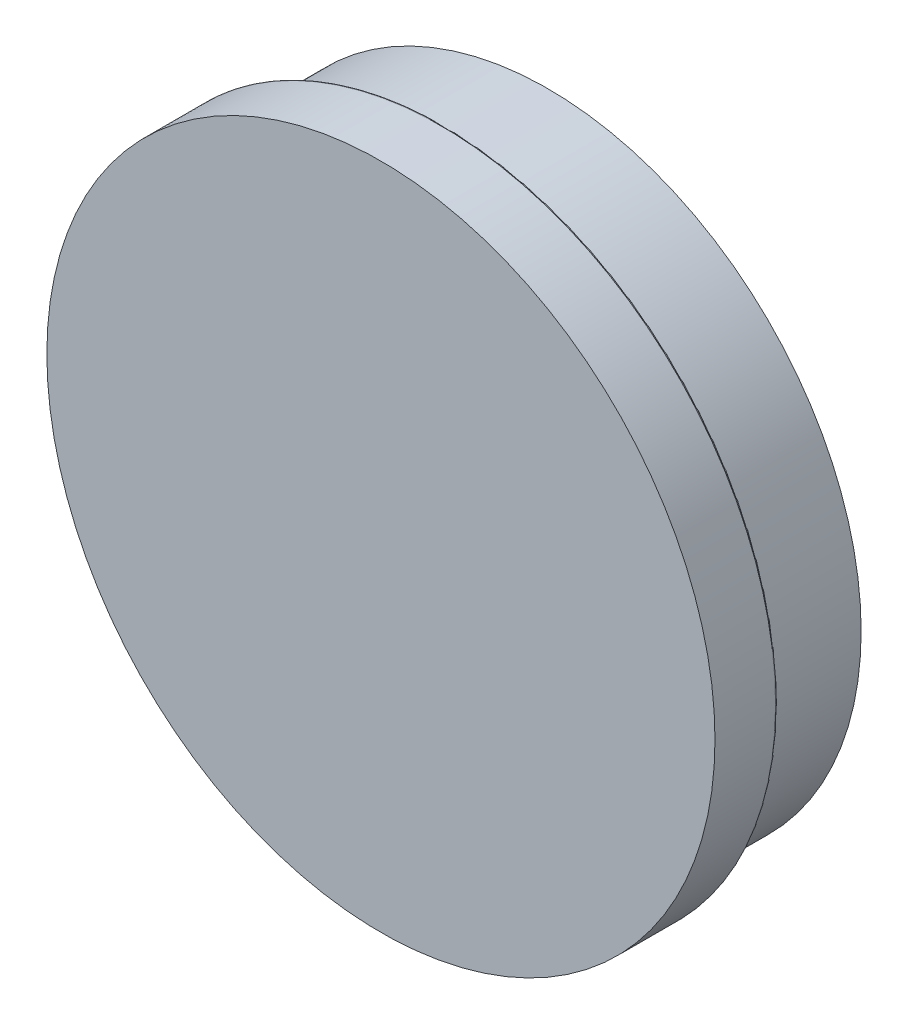
ISO-10303-21;
HEADER;
FILE_DESCRIPTION(('STEP AP214'),'2;1');
FILE_NAME('part.step','',(''),(''),'','','');
FILE_SCHEMA(('AUTOMOTIVE_DESIGN { 1 0 10303 214 1 1 1 1 }'));
ENDSEC;
DATA;
#1=APPLICATION_CONTEXT('core data for automotive mechanical design processes');
#2=APPLICATION_PROTOCOL_DEFINITION('international standard','automotive_design',2000,#1);
#3=PRODUCT_CONTEXT('',#1,'mechanical');
#4=PRODUCT('Part','Part','',(#3));
#5=PRODUCT_RELATED_PRODUCT_CATEGORY('part','',(#4));
#6=PRODUCT_DEFINITION_FORMATION('','',#4);
#7=PRODUCT_DEFINITION_CONTEXT('part definition',#1,'design');
#8=PRODUCT_DEFINITION('design','',#6,#7);
#9=PRODUCT_DEFINITION_SHAPE('','',#8);
#10=(LENGTH_UNIT() NAMED_UNIT(*) SI_UNIT(.MILLI.,.METRE.));
#11=(NAMED_UNIT(*) PLANE_ANGLE_UNIT() SI_UNIT($,.RADIAN.));
#12=(NAMED_UNIT(*) SI_UNIT($,.STERADIAN.) SOLID_ANGLE_UNIT());
#13=UNCERTAINTY_MEASURE_WITH_UNIT(LENGTH_MEASURE(1.E-05),#10,'distance_accuracy_value','');
#14=(GEOMETRIC_REPRESENTATION_CONTEXT(3) GLOBAL_UNCERTAINTY_ASSIGNED_CONTEXT((#13)) GLOBAL_UNIT_ASSIGNED_CONTEXT((#10,
#11,#12)) REPRESENTATION_CONTEXT('',''));
#15=CARTESIAN_POINT('',(0.,0.,0.));
#16=DIRECTION('',(0.,0.,1.));
#17=DIRECTION('',(1.,0.,0.));
#18=AXIS2_PLACEMENT_3D('',#15,#16,#17);
#19=CARTESIAN_POINT('',(0.,0.,5.));
#20=DIRECTION('',(0.,0.,-1.));
#21=DIRECTION('',(-1.,0.,0.));
#22=AXIS2_PLACEMENT_3D('',#19,#20,#21);
#23=CYLINDRICAL_SURFACE('',#22,15.);
#24=CARTESIAN_POINT('',(0.,0.,4.9));
#25=DIRECTION('',(0.,0.,1.));
#26=DIRECTION('',(1.,0.,0.));
#27=AXIS2_PLACEMENT_3D('',#24,#25,#26);
#28=CIRCLE('',#27,15.);
#29=CARTESIAN_POINT('',(15.,0.,4.9));
#30=VERTEX_POINT('',#29);
#31=EDGE_CURVE('E10',#30,#30,#28,.F.);
#32=ORIENTED_EDGE('',*,*,#31,.T.);
#33=EDGE_LOOP('',(#32));
#34=FACE_BOUND('',#33,.T.);
#35=CARTESIAN_POINT('',(0.,0.,0.));
#36=DIRECTION('',(0.,0.,1.));
#37=DIRECTION('',(1.,0.,0.));
#38=AXIS2_PLACEMENT_3D('',#35,#36,#37);
#39=CIRCLE('',#38,15.);
#40=CARTESIAN_POINT('',(15.,0.,0.));
#41=VERTEX_POINT('',#40);
#42=EDGE_CURVE('E66',#41,#41,#39,.T.);
#43=ORIENTED_EDGE('',*,*,#42,.T.);
#44=EDGE_LOOP('',(#43));
#45=FACE_BOUND('',#44,.T.);
#46=ADVANCED_FACE('F34',(#34,#45),#23,.T.);
#47=CARTESIAN_POINT('',(0.,0.,0.));
#48=DIRECTION('',(0.,0.,1.));
#49=DIRECTION('',(1.,0.,0.));
#50=AXIS2_PLACEMENT_3D('',#47,#48,#49);
#51=PLANE('',#50);
#52=CARTESIAN_POINT('',(0.,0.,0.));
#53=DIRECTION('',(0.,0.,1.));
#54=DIRECTION('',(1.,0.,0.));
#55=AXIS2_PLACEMENT_3D('',#52,#53,#54);
#56=CIRCLE('',#55,11.7);
#57=CARTESIAN_POINT('',(11.7,0.,0.));
#58=VERTEX_POINT('',#57);
#59=EDGE_CURVE('E54',#58,#58,#56,.T.);
#60=ORIENTED_EDGE('',*,*,#59,.T.);
#61=EDGE_LOOP('',(#60));
#62=FACE_BOUND('',#61,.T.);
#63=ORIENTED_EDGE('',*,*,#42,.F.);
#64=EDGE_LOOP('',(#63));
#65=FACE_BOUND('',#64,.T.);
#66=ADVANCED_FACE('F92',(#62,#65),#51,.F.);
#67=CARTESIAN_POINT('',(0.,0.,3.));
#68=DIRECTION('',(0.,0.,-1.));
#69=DIRECTION('',(-1.,0.,0.));
#70=AXIS2_PLACEMENT_3D('',#67,#68,#69);
#71=CYLINDRICAL_SURFACE('',#70,11.5);
#72=CARTESIAN_POINT('',(0.,0.,0.2));
#73=DIRECTION('',(0.,0.,1.));
#74=DIRECTION('',(1.,0.,0.));
#75=AXIS2_PLACEMENT_3D('',#72,#73,#74);
#76=CIRCLE('',#75,11.5);
#77=CARTESIAN_POINT('',(11.5,0.,0.2));
#78=VERTEX_POINT('',#77);
#79=EDGE_CURVE('E57',#78,#78,#76,.F.);
#80=ORIENTED_EDGE('',*,*,#79,.T.);
#81=EDGE_LOOP('',(#80));
#82=FACE_BOUND('',#81,.T.);
#83=CARTESIAN_POINT('',(0.,0.,2.));
#84=DIRECTION('',(0.,0.,-1.));
#85=DIRECTION('',(-1.,0.,0.));
#86=AXIS2_PLACEMENT_3D('',#83,#84,#85);
#87=CIRCLE('',#86,11.5);
#88=CARTESIAN_POINT('',(-11.5,0.,2.));
#89=VERTEX_POINT('',#88);
#90=EDGE_CURVE('E60',#89,#89,#87,.F.);
#91=ORIENTED_EDGE('',*,*,#90,.T.);
#92=EDGE_LOOP('',(#91));
#93=FACE_BOUND('',#92,.T.);
#94=ADVANCED_FACE('F97',(#82,#93),#71,.F.);
#95=CARTESIAN_POINT('',(0.,0.,3.));
#96=DIRECTION('',(0.,0.,-1.));
#97=DIRECTION('',(-1.,0.,0.));
#98=AXIS2_PLACEMENT_3D('',#95,#96,#97);
#99=PLANE('',#98);
#100=CARTESIAN_POINT('',(0.,0.,3.));
#101=DIRECTION('',(0.,0.,-1.));
#102=DIRECTION('',(-1.,0.,0.));
#103=AXIS2_PLACEMENT_3D('',#100,#101,#102);
#104=CIRCLE('',#103,10.5);
#105=CARTESIAN_POINT('',(-10.5,0.,3.));
#106=VERTEX_POINT('',#105);
#107=EDGE_CURVE('E63',#106,#106,#104,.T.);
#108=ORIENTED_EDGE('',*,*,#107,.T.);
#109=EDGE_LOOP('',(#108));
#110=FACE_BOUND('',#109,.T.);
#111=ADVANCED_FACE('F104',(#110),#99,.T.);
#112=CARTESIAN_POINT('',(0.,0.,2.));
#113=DIRECTION('',(0.,0.,-1.));
#114=DIRECTION('',(-1.,0.,0.));
#115=AXIS2_PLACEMENT_3D('',#112,#113,#114);
#116=TOROIDAL_SURFACE('',#115,10.5,1.);
#117=ORIENTED_EDGE('',*,*,#90,.F.);
#118=EDGE_LOOP('',(#117));
#119=FACE_BOUND('',#118,.T.);
#120=ORIENTED_EDGE('',*,*,#107,.F.);
#121=EDGE_LOOP('',(#120));
#122=FACE_BOUND('',#121,.T.);
#123=ADVANCED_FACE('F86',(#119,#122),#116,.F.);
#124=CARTESIAN_POINT('',(0.,0.,0.2));
#125=DIRECTION('',(0.,0.,1.));
#126=DIRECTION('',(1.,0.,0.));
#127=AXIS2_PLACEMENT_3D('',#124,#125,#126);
#128=TOROIDAL_SURFACE('',#127,11.7,0.2);
#129=ORIENTED_EDGE('',*,*,#59,.F.);
#130=EDGE_LOOP('',(#129));
#131=FACE_BOUND('',#130,.T.);
#132=ORIENTED_EDGE('',*,*,#79,.F.);
#133=EDGE_LOOP('',(#132));
#134=FACE_BOUND('',#133,.T.);
#135=ADVANCED_FACE('F77',(#131,#134),#128,.T.);
#136=CARTESIAN_POINT('',(0.,0.,8.));
#137=DIRECTION('',(0.,0.,-1.));
#138=DIRECTION('',(-1.,0.,0.));
#139=AXIS2_PLACEMENT_3D('',#136,#137,#138);
#140=CYLINDRICAL_SURFACE('',#139,16.);
#141=CARTESIAN_POINT('',(0.,0.,5.1));
#142=DIRECTION('',(0.,0.,1.));
#143=DIRECTION('',(1.,0.,0.));
#144=AXIS2_PLACEMENT_3D('',#141,#142,#143);
#145=CIRCLE('',#144,16.);
#146=CARTESIAN_POINT('',(16.,0.,5.1));
#147=VERTEX_POINT('',#146);
#148=EDGE_CURVE('E49',#147,#147,#145,.T.);
#149=ORIENTED_EDGE('',*,*,#148,.T.);
#150=EDGE_LOOP('',(#149));
#151=FACE_BOUND('',#150,.T.);
#152=CARTESIAN_POINT('',(0.,0.,8.));
#153=DIRECTION('',(0.,0.,1.));
#154=DIRECTION('',(1.,0.,0.));
#155=AXIS2_PLACEMENT_3D('',#152,#153,#154);
#156=CIRCLE('',#155,16.);
#157=CARTESIAN_POINT('',(16.,0.,8.));
#158=VERTEX_POINT('',#157);
#159=EDGE_CURVE('E69',#158,#158,#156,.T.);
#160=ORIENTED_EDGE('',*,*,#159,.F.);
#161=EDGE_LOOP('',(#160));
#162=FACE_BOUND('',#161,.T.);
#163=ADVANCED_FACE('F75',(#151,#162),#140,.T.);
#164=CARTESIAN_POINT('',(0.,0.,8.));
#165=DIRECTION('',(0.,0.,1.));
#166=DIRECTION('',(1.,0.,0.));
#167=AXIS2_PLACEMENT_3D('',#164,#165,#166);
#168=PLANE('',#167);
#169=ORIENTED_EDGE('',*,*,#159,.T.);
#170=EDGE_LOOP('',(#169));
#171=FACE_BOUND('',#170,.T.);
#172=ADVANCED_FACE('F73',(#171),#168,.T.);
#173=CARTESIAN_POINT('',(0.,0.,5.));
#174=DIRECTION('',(0.,0.,1.));
#175=DIRECTION('',(1.,0.,0.));
#176=AXIS2_PLACEMENT_3D('',#173,#174,#175);
#177=PLANE('',#176);
#178=CARTESIAN_POINT('',(0.,0.,5.));
#179=DIRECTION('',(0.,0.,1.));
#180=DIRECTION('',(1.,0.,0.));
#181=AXIS2_PLACEMENT_3D('',#178,#179,#180);
#182=CIRCLE('',#181,15.9);
#183=CARTESIAN_POINT('',(15.9,0.,5.));
#184=VERTEX_POINT('',#183);
#185=EDGE_CURVE('E41',#184,#184,#182,.F.);
#186=ORIENTED_EDGE('',*,*,#185,.T.);
#187=EDGE_LOOP('',(#186));
#188=FACE_BOUND('',#187,.T.);
#189=CARTESIAN_POINT('',(0.,0.,5.));
#190=DIRECTION('',(0.,0.,1.));
#191=DIRECTION('',(1.,0.,0.));
#192=AXIS2_PLACEMENT_3D('',#189,#190,#191);
#193=CIRCLE('',#192,15.1);
#194=CARTESIAN_POINT('',(15.1,0.,5.));
#195=VERTEX_POINT('',#194);
#196=EDGE_CURVE('E45',#195,#195,#193,.T.);
#197=ORIENTED_EDGE('',*,*,#196,.T.);
#198=EDGE_LOOP('',(#197));
#199=FACE_BOUND('',#198,.T.);
#200=ADVANCED_FACE('F84',(#188,#199),#177,.F.);
#201=CARTESIAN_POINT('',(0.,0.,5.1));
#202=DIRECTION('',(0.,0.,1.));
#203=DIRECTION('',(1.,0.,0.));
#204=AXIS2_PLACEMENT_3D('',#201,#202,#203);
#205=TOROIDAL_SURFACE('',#204,15.9,0.1);
#206=ORIENTED_EDGE('',*,*,#185,.F.);
#207=EDGE_LOOP('',(#206));
#208=FACE_BOUND('',#207,.T.);
#209=ORIENTED_EDGE('',*,*,#148,.F.);
#210=EDGE_LOOP('',(#209));
#211=FACE_BOUND('',#210,.T.);
#212=ADVANCED_FACE('F106',(#208,#211),#205,.T.);
#213=CARTESIAN_POINT('',(0.,0.,4.9));
#214=DIRECTION('',(0.,0.,1.));
#215=DIRECTION('',(1.,0.,0.));
#216=AXIS2_PLACEMENT_3D('',#213,#214,#215);
#217=TOROIDAL_SURFACE('',#216,15.1,0.1);
#218=ORIENTED_EDGE('',*,*,#31,.F.);
#219=EDGE_LOOP('',(#218));
#220=FACE_BOUND('',#219,.T.);
#221=ORIENTED_EDGE('',*,*,#196,.F.);
#222=EDGE_LOOP('',(#221));
#223=FACE_BOUND('',#222,.T.);
#224=ADVANCED_FACE('F36',(#220,#223),#217,.F.);
#225=CLOSED_SHELL('',(#46,#66,#94,#111,#123,#135,#163,#172,#200,#212,#224));
#226=MANIFOLD_SOLID_BREP('B2',#225);
#227=ADVANCED_BREP_SHAPE_REPRESENTATION('',(#18,#226),#14);
#228=SHAPE_DEFINITION_REPRESENTATION(#9,#227);
ENDSEC;
END-ISO-10303-21;
